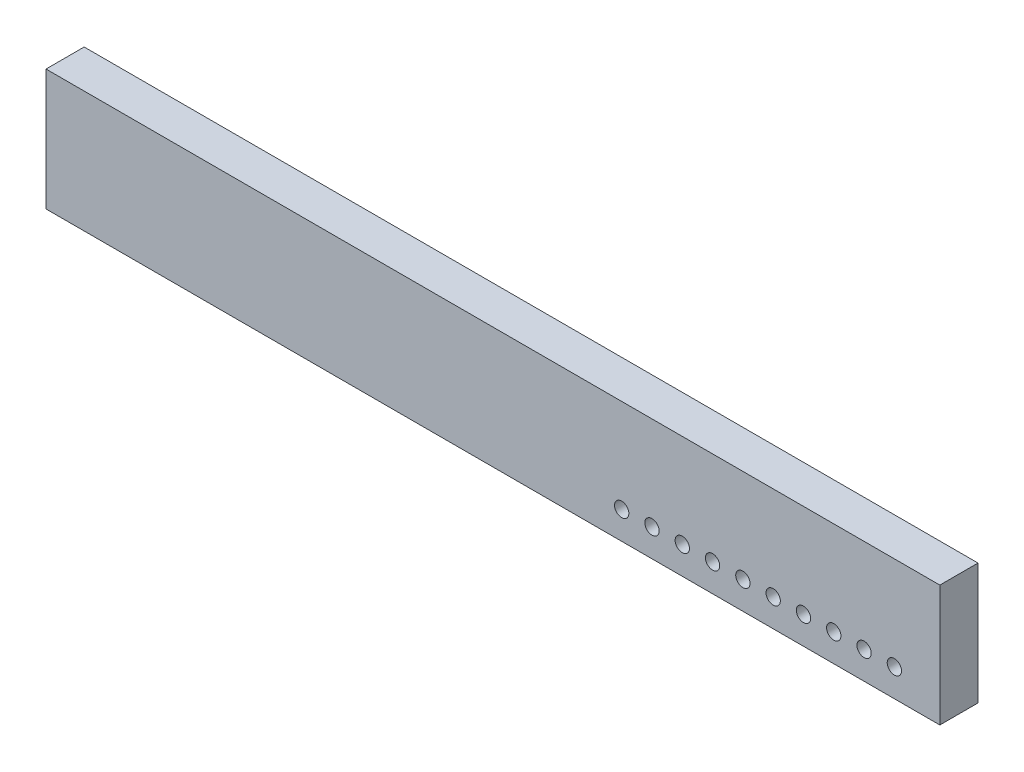
ISO-10303-21;
HEADER;
FILE_DESCRIPTION(('STEP AP214'),'2;1');
FILE_NAME('part.step','',(''),(''),'','','');
FILE_SCHEMA(('AUTOMOTIVE_DESIGN { 1 0 10303 214 1 1 1 1 }'));
ENDSEC;
DATA;
#1=APPLICATION_CONTEXT('core data for automotive mechanical design processes');
#2=APPLICATION_PROTOCOL_DEFINITION('international standard','automotive_design',2000,#1);
#3=PRODUCT_CONTEXT('',#1,'mechanical');
#4=PRODUCT('Part','Part','',(#3));
#5=PRODUCT_RELATED_PRODUCT_CATEGORY('part','',(#4));
#6=PRODUCT_DEFINITION_FORMATION('','',#4);
#7=PRODUCT_DEFINITION_CONTEXT('part definition',#1,'design');
#8=PRODUCT_DEFINITION('design','',#6,#7);
#9=PRODUCT_DEFINITION_SHAPE('','',#8);
#10=(LENGTH_UNIT() NAMED_UNIT(*) SI_UNIT(.MILLI.,.METRE.));
#11=(NAMED_UNIT(*) PLANE_ANGLE_UNIT() SI_UNIT($,.RADIAN.));
#12=(NAMED_UNIT(*) SI_UNIT($,.STERADIAN.) SOLID_ANGLE_UNIT());
#13=UNCERTAINTY_MEASURE_WITH_UNIT(LENGTH_MEASURE(1.E-05),#10,'distance_accuracy_value','');
#14=(GEOMETRIC_REPRESENTATION_CONTEXT(3) GLOBAL_UNCERTAINTY_ASSIGNED_CONTEXT((#13)) GLOBAL_UNIT_ASSIGNED_CONTEXT((#10,
#11,#12)) REPRESENTATION_CONTEXT('',''));
#15=CARTESIAN_POINT('',(0.,0.,0.));
#16=DIRECTION('',(0.,0.,1.));
#17=DIRECTION('',(1.,0.,0.));
#18=AXIS2_PLACEMENT_3D('',#15,#16,#17);
#19=CARTESIAN_POINT('',(18.7325,-2.54,1.6));
#20=DIRECTION('',(-1.,0.,0.));
#21=DIRECTION('',(0.,0.,1.));
#22=AXIS2_PLACEMENT_3D('',#19,#20,#21);
#23=PLANE('',#22);
#24=DIRECTION('',(0.,1.,0.));
#25=VECTOR('',#24,1.);
#26=CARTESIAN_POINT('',(18.7325,-2.54,0.));
#27=LINE('',#26,#25);
#28=CARTESIAN_POINT('',(18.7325,-2.54,0.));
#29=VERTEX_POINT('',#28);
#30=CARTESIAN_POINT('',(18.7325,2.54,0.));
#31=VERTEX_POINT('',#30);
#32=EDGE_CURVE('E100',#29,#31,#27,.T.);
#33=ORIENTED_EDGE('',*,*,#32,.T.);
#34=DIRECTION('',(0.,0.,-1.));
#35=VECTOR('',#34,1.);
#36=CARTESIAN_POINT('',(18.7325,2.54,1.6));
#37=LINE('',#36,#35);
#38=CARTESIAN_POINT('',(18.7325,2.54,1.6));
#39=VERTEX_POINT('',#38);
#40=EDGE_CURVE('E87',#39,#31,#37,.T.);
#41=ORIENTED_EDGE('',*,*,#40,.F.);
#42=DIRECTION('',(0.,1.,0.));
#43=VECTOR('',#42,1.);
#44=CARTESIAN_POINT('',(18.7325,-2.54,1.6));
#45=LINE('',#44,#43);
#46=CARTESIAN_POINT('',(18.7325,-2.54,1.6));
#47=VERTEX_POINT('',#46);
#48=EDGE_CURVE('E106',#47,#39,#45,.T.);
#49=ORIENTED_EDGE('',*,*,#48,.F.);
#50=DIRECTION('',(0.,0.,-1.));
#51=VECTOR('',#50,1.);
#52=CARTESIAN_POINT('',(18.7325,-2.54,1.6));
#53=LINE('',#52,#51);
#54=EDGE_CURVE('E89',#47,#29,#53,.T.);
#55=ORIENTED_EDGE('',*,*,#54,.T.);
#56=EDGE_LOOP('',(#33,#41,#49,#55));
#57=FACE_BOUND('',#56,.T.);
#58=ADVANCED_FACE('F32',(#57),#23,.F.);
#59=CARTESIAN_POINT('',(-18.7325,2.54,1.6));
#60=DIRECTION('',(0.,-1.,0.));
#61=DIRECTION('',(0.,0.,-1.));
#62=AXIS2_PLACEMENT_3D('',#59,#60,#61);
#63=PLANE('',#62);
#64=DIRECTION('',(-1.,0.,0.));
#65=VECTOR('',#64,1.);
#66=CARTESIAN_POINT('',(-18.7325,2.54,0.));
#67=LINE('',#66,#65);
#68=CARTESIAN_POINT('',(-18.7325,2.54,0.));
#69=VERTEX_POINT('',#68);
#70=EDGE_CURVE('E50',#31,#69,#67,.T.);
#71=ORIENTED_EDGE('',*,*,#70,.T.);
#72=DIRECTION('',(0.,0.,-1.));
#73=VECTOR('',#72,1.);
#74=CARTESIAN_POINT('',(-18.7325,2.54,1.6));
#75=LINE('',#74,#73);
#76=CARTESIAN_POINT('',(-18.7325,2.54,1.6));
#77=VERTEX_POINT('',#76);
#78=EDGE_CURVE('E84',#77,#69,#75,.T.);
#79=ORIENTED_EDGE('',*,*,#78,.F.);
#80=DIRECTION('',(-1.,0.,0.));
#81=VECTOR('',#80,1.);
#82=CARTESIAN_POINT('',(-18.7325,2.54,1.6));
#83=LINE('',#82,#81);
#84=EDGE_CURVE('E66',#39,#77,#83,.T.);
#85=ORIENTED_EDGE('',*,*,#84,.F.);
#86=ORIENTED_EDGE('',*,*,#40,.T.);
#87=EDGE_LOOP('',(#71,#79,#85,#86));
#88=FACE_BOUND('',#87,.T.);
#89=ADVANCED_FACE('F83',(#88),#63,.F.);
#90=CARTESIAN_POINT('',(-18.7325,-2.54,1.6));
#91=DIRECTION('',(1.,0.,0.));
#92=DIRECTION('',(0.,0.,-1.));
#93=AXIS2_PLACEMENT_3D('',#90,#91,#92);
#94=PLANE('',#93);
#95=DIRECTION('',(0.,-1.,0.));
#96=VECTOR('',#95,1.);
#97=CARTESIAN_POINT('',(-18.7325,-2.54,0.));
#98=LINE('',#97,#96);
#99=CARTESIAN_POINT('',(-18.7325,-2.54,0.));
#100=VERTEX_POINT('',#99);
#101=EDGE_CURVE('E81',#69,#100,#98,.T.);
#102=ORIENTED_EDGE('',*,*,#101,.T.);
#103=DIRECTION('',(0.,0.,-1.));
#104=VECTOR('',#103,1.);
#105=CARTESIAN_POINT('',(-18.7325,-2.54,1.6));
#106=LINE('',#105,#104);
#107=CARTESIAN_POINT('',(-18.7325,-2.54,1.6));
#108=VERTEX_POINT('',#107);
#109=EDGE_CURVE('E108',#108,#100,#106,.T.);
#110=ORIENTED_EDGE('',*,*,#109,.F.);
#111=DIRECTION('',(0.,-1.,0.));
#112=VECTOR('',#111,1.);
#113=CARTESIAN_POINT('',(-18.7325,-2.54,1.6));
#114=LINE('',#113,#112);
#115=EDGE_CURVE('E92',#77,#108,#114,.T.);
#116=ORIENTED_EDGE('',*,*,#115,.F.);
#117=ORIENTED_EDGE('',*,*,#78,.T.);
#118=EDGE_LOOP('',(#102,#110,#116,#117));
#119=FACE_BOUND('',#118,.T.);
#120=ADVANCED_FACE('F91',(#119),#94,.F.);
#121=CARTESIAN_POINT('',(-18.7325,-2.54,1.6));
#122=DIRECTION('',(0.,1.,0.));
#123=DIRECTION('',(0.,0.,1.));
#124=AXIS2_PLACEMENT_3D('',#121,#122,#123);
#125=PLANE('',#124);
#126=DIRECTION('',(1.,0.,0.));
#127=VECTOR('',#126,1.);
#128=CARTESIAN_POINT('',(-18.7325,-2.54,0.));
#129=LINE('',#128,#127);
#130=EDGE_CURVE('E75',#100,#29,#129,.T.);
#131=ORIENTED_EDGE('',*,*,#130,.T.);
#132=ORIENTED_EDGE('',*,*,#54,.F.);
#133=DIRECTION('',(1.,0.,0.));
#134=VECTOR('',#133,1.);
#135=CARTESIAN_POINT('',(-18.7325,-2.54,1.6));
#136=LINE('',#135,#134);
#137=EDGE_CURVE('E102',#108,#47,#136,.T.);
#138=ORIENTED_EDGE('',*,*,#137,.F.);
#139=ORIENTED_EDGE('',*,*,#109,.T.);
#140=EDGE_LOOP('',(#131,#132,#138,#139));
#141=FACE_BOUND('',#140,.T.);
#142=ADVANCED_FACE('F176',(#141),#125,.F.);
#143=CARTESIAN_POINT('',(0.,0.,1.6));
#144=DIRECTION('',(0.,0.,-1.));
#145=DIRECTION('',(-1.,0.,0.));
#146=AXIS2_PLACEMENT_3D('',#143,#144,#145);
#147=PLANE('',#146);
#148=CARTESIAN_POINT('',(5.39750000000004,-1.37999999999999,1.6));
#149=DIRECTION('',(0.,0.,1.));
#150=DIRECTION('',(1.,0.,0.));
#151=AXIS2_PLACEMENT_3D('',#148,#149,#150);
#152=CIRCLE('',#151,0.3);
#153=CARTESIAN_POINT('',(5.69750000000004,-1.37999999999999,1.6));
#154=VERTEX_POINT('',#153);
#155=EDGE_CURVE('E11',#154,#154,#152,.T.);
#156=ORIENTED_EDGE('',*,*,#155,.F.);
#157=EDGE_LOOP('',(#156));
#158=FACE_BOUND('',#157,.T.);
#159=CARTESIAN_POINT('',(6.66750000000004,-1.37999999999999,1.6));
#160=DIRECTION('',(0.,0.,1.));
#161=DIRECTION('',(1.,0.,0.));
#162=AXIS2_PLACEMENT_3D('',#159,#160,#161);
#163=CIRCLE('',#162,0.3);
#164=CARTESIAN_POINT('',(6.96750000000004,-1.37999999999999,1.6));
#165=VERTEX_POINT('',#164);
#166=EDGE_CURVE('E42',#165,#165,#163,.T.);
#167=ORIENTED_EDGE('',*,*,#166,.F.);
#168=EDGE_LOOP('',(#167));
#169=FACE_BOUND('',#168,.T.);
#170=CARTESIAN_POINT('',(7.93750000000004,-1.37999999999999,1.6));
#171=DIRECTION('',(0.,0.,1.));
#172=DIRECTION('',(1.,0.,0.));
#173=AXIS2_PLACEMENT_3D('',#170,#171,#172);
#174=CIRCLE('',#173,0.3);
#175=CARTESIAN_POINT('',(8.23750000000004,-1.37999999999999,1.6));
#176=VERTEX_POINT('',#175);
#177=EDGE_CURVE('E149',#176,#176,#174,.T.);
#178=ORIENTED_EDGE('',*,*,#177,.F.);
#179=EDGE_LOOP('',(#178));
#180=FACE_BOUND('',#179,.T.);
#181=CARTESIAN_POINT('',(9.20750000000004,-1.37999999999999,1.6));
#182=DIRECTION('',(0.,0.,1.));
#183=DIRECTION('',(1.,0.,0.));
#184=AXIS2_PLACEMENT_3D('',#181,#182,#183);
#185=CIRCLE('',#184,0.3);
#186=CARTESIAN_POINT('',(9.50750000000004,-1.37999999999999,1.6));
#187=VERTEX_POINT('',#186);
#188=EDGE_CURVE('E143',#187,#187,#185,.T.);
#189=ORIENTED_EDGE('',*,*,#188,.F.);
#190=EDGE_LOOP('',(#189));
#191=FACE_BOUND('',#190,.T.);
#192=CARTESIAN_POINT('',(10.4775,-1.37999999999999,1.6));
#193=DIRECTION('',(0.,0.,1.));
#194=DIRECTION('',(1.,0.,0.));
#195=AXIS2_PLACEMENT_3D('',#192,#193,#194);
#196=CIRCLE('',#195,0.3);
#197=CARTESIAN_POINT('',(10.7775,-1.37999999999999,1.6));
#198=VERTEX_POINT('',#197);
#199=EDGE_CURVE('E137',#198,#198,#196,.T.);
#200=ORIENTED_EDGE('',*,*,#199,.F.);
#201=EDGE_LOOP('',(#200));
#202=FACE_BOUND('',#201,.T.);
#203=CARTESIAN_POINT('',(11.7475,-1.37999999999999,1.6));
#204=DIRECTION('',(0.,0.,1.));
#205=DIRECTION('',(1.,0.,0.));
#206=AXIS2_PLACEMENT_3D('',#203,#204,#205);
#207=CIRCLE('',#206,0.3);
#208=CARTESIAN_POINT('',(12.0475,-1.37999999999999,1.6));
#209=VERTEX_POINT('',#208);
#210=EDGE_CURVE('E131',#209,#209,#207,.T.);
#211=ORIENTED_EDGE('',*,*,#210,.F.);
#212=EDGE_LOOP('',(#211));
#213=FACE_BOUND('',#212,.T.);
#214=CARTESIAN_POINT('',(13.0175,-1.37999999999999,1.6));
#215=DIRECTION('',(0.,0.,1.));
#216=DIRECTION('',(1.,0.,0.));
#217=AXIS2_PLACEMENT_3D('',#214,#215,#216);
#218=CIRCLE('',#217,0.3);
#219=CARTESIAN_POINT('',(13.3175,-1.37999999999999,1.6));
#220=VERTEX_POINT('',#219);
#221=EDGE_CURVE('E125',#220,#220,#218,.T.);
#222=ORIENTED_EDGE('',*,*,#221,.F.);
#223=EDGE_LOOP('',(#222));
#224=FACE_BOUND('',#223,.T.);
#225=CARTESIAN_POINT('',(14.2875,-1.37999999999999,1.6));
#226=DIRECTION('',(0.,0.,1.));
#227=DIRECTION('',(1.,0.,0.));
#228=AXIS2_PLACEMENT_3D('',#225,#226,#227);
#229=CIRCLE('',#228,0.3);
#230=CARTESIAN_POINT('',(14.5875,-1.37999999999999,1.6));
#231=VERTEX_POINT('',#230);
#232=EDGE_CURVE('E119',#231,#231,#229,.T.);
#233=ORIENTED_EDGE('',*,*,#232,.F.);
#234=EDGE_LOOP('',(#233));
#235=FACE_BOUND('',#234,.T.);
#236=CARTESIAN_POINT('',(15.5575,-1.37999999999999,1.6));
#237=DIRECTION('',(0.,0.,1.));
#238=DIRECTION('',(1.,0.,0.));
#239=AXIS2_PLACEMENT_3D('',#236,#237,#238);
#240=CIRCLE('',#239,0.3);
#241=CARTESIAN_POINT('',(15.8575,-1.37999999999999,1.6));
#242=VERTEX_POINT('',#241);
#243=EDGE_CURVE('E112',#242,#242,#240,.T.);
#244=ORIENTED_EDGE('',*,*,#243,.F.);
#245=EDGE_LOOP('',(#244));
#246=FACE_BOUND('',#245,.T.);
#247=CARTESIAN_POINT('',(16.8275,-1.37999999999999,1.6));
#248=DIRECTION('',(0.,0.,1.));
#249=DIRECTION('',(1.,0.,0.));
#250=AXIS2_PLACEMENT_3D('',#247,#248,#249);
#251=CIRCLE('',#250,0.3);
#252=CARTESIAN_POINT('',(17.1275,-1.37999999999999,1.6));
#253=VERTEX_POINT('',#252);
#254=EDGE_CURVE('E109',#253,#253,#251,.T.);
#255=ORIENTED_EDGE('',*,*,#254,.F.);
#256=EDGE_LOOP('',(#255));
#257=FACE_BOUND('',#256,.T.);
#258=ORIENTED_EDGE('',*,*,#48,.T.);
#259=ORIENTED_EDGE('',*,*,#84,.T.);
#260=ORIENTED_EDGE('',*,*,#115,.T.);
#261=ORIENTED_EDGE('',*,*,#137,.T.);
#262=EDGE_LOOP('',(#258,#259,#260,#261));
#263=FACE_BOUND('',#262,.T.);
#264=ADVANCED_FACE('F34',(#158,#169,#180,#191,#202,#213,#224,#235,#246,#257,#263),#147,.F.);
#265=CARTESIAN_POINT('',(0.,0.,0.));
#266=DIRECTION('',(0.,0.,-1.));
#267=DIRECTION('',(-1.,0.,0.));
#268=AXIS2_PLACEMENT_3D('',#265,#266,#267);
#269=PLANE('',#268);
#270=CARTESIAN_POINT('',(5.39750000000004,-1.37999999999999,0.));
#271=DIRECTION('',(0.,0.,1.));
#272=DIRECTION('',(1.,0.,0.));
#273=AXIS2_PLACEMENT_3D('',#270,#271,#272);
#274=CIRCLE('',#273,0.3);
#275=CARTESIAN_POINT('',(5.69750000000004,-1.37999999999999,0.));
#276=VERTEX_POINT('',#275);
#277=EDGE_CURVE('E36',#276,#276,#274,.T.);
#278=ORIENTED_EDGE('',*,*,#277,.T.);
#279=EDGE_LOOP('',(#278));
#280=FACE_BOUND('',#279,.T.);
#281=CARTESIAN_POINT('',(6.66750000000004,-1.37999999999999,0.));
#282=DIRECTION('',(0.,0.,1.));
#283=DIRECTION('',(1.,0.,0.));
#284=AXIS2_PLACEMENT_3D('',#281,#282,#283);
#285=CIRCLE('',#284,0.3);
#286=CARTESIAN_POINT('',(6.96750000000004,-1.37999999999999,0.));
#287=VERTEX_POINT('',#286);
#288=EDGE_CURVE('E157',#287,#287,#285,.T.);
#289=ORIENTED_EDGE('',*,*,#288,.T.);
#290=EDGE_LOOP('',(#289));
#291=FACE_BOUND('',#290,.T.);
#292=CARTESIAN_POINT('',(7.93750000000004,-1.37999999999999,0.));
#293=DIRECTION('',(0.,0.,1.));
#294=DIRECTION('',(1.,0.,0.));
#295=AXIS2_PLACEMENT_3D('',#292,#293,#294);
#296=CIRCLE('',#295,0.3);
#297=CARTESIAN_POINT('',(8.23750000000004,-1.37999999999999,0.));
#298=VERTEX_POINT('',#297);
#299=EDGE_CURVE('E152',#298,#298,#296,.T.);
#300=ORIENTED_EDGE('',*,*,#299,.T.);
#301=EDGE_LOOP('',(#300));
#302=FACE_BOUND('',#301,.T.);
#303=CARTESIAN_POINT('',(9.20750000000004,-1.37999999999999,0.));
#304=DIRECTION('',(0.,0.,1.));
#305=DIRECTION('',(1.,0.,0.));
#306=AXIS2_PLACEMENT_3D('',#303,#304,#305);
#307=CIRCLE('',#306,0.3);
#308=CARTESIAN_POINT('',(9.50750000000004,-1.37999999999999,0.));
#309=VERTEX_POINT('',#308);
#310=EDGE_CURVE('E146',#309,#309,#307,.T.);
#311=ORIENTED_EDGE('',*,*,#310,.T.);
#312=EDGE_LOOP('',(#311));
#313=FACE_BOUND('',#312,.T.);
#314=CARTESIAN_POINT('',(10.4775,-1.37999999999999,0.));
#315=DIRECTION('',(0.,0.,1.));
#316=DIRECTION('',(1.,0.,0.));
#317=AXIS2_PLACEMENT_3D('',#314,#315,#316);
#318=CIRCLE('',#317,0.3);
#319=CARTESIAN_POINT('',(10.7775,-1.37999999999999,0.));
#320=VERTEX_POINT('',#319);
#321=EDGE_CURVE('E140',#320,#320,#318,.T.);
#322=ORIENTED_EDGE('',*,*,#321,.T.);
#323=EDGE_LOOP('',(#322));
#324=FACE_BOUND('',#323,.T.);
#325=CARTESIAN_POINT('',(11.7475,-1.37999999999999,0.));
#326=DIRECTION('',(0.,0.,1.));
#327=DIRECTION('',(1.,0.,0.));
#328=AXIS2_PLACEMENT_3D('',#325,#326,#327);
#329=CIRCLE('',#328,0.3);
#330=CARTESIAN_POINT('',(12.0475,-1.37999999999999,0.));
#331=VERTEX_POINT('',#330);
#332=EDGE_CURVE('E134',#331,#331,#329,.T.);
#333=ORIENTED_EDGE('',*,*,#332,.T.);
#334=EDGE_LOOP('',(#333));
#335=FACE_BOUND('',#334,.T.);
#336=CARTESIAN_POINT('',(13.0175,-1.37999999999999,0.));
#337=DIRECTION('',(0.,0.,1.));
#338=DIRECTION('',(1.,0.,0.));
#339=AXIS2_PLACEMENT_3D('',#336,#337,#338);
#340=CIRCLE('',#339,0.3);
#341=CARTESIAN_POINT('',(13.3175,-1.37999999999999,0.));
#342=VERTEX_POINT('',#341);
#343=EDGE_CURVE('E128',#342,#342,#340,.T.);
#344=ORIENTED_EDGE('',*,*,#343,.T.);
#345=EDGE_LOOP('',(#344));
#346=FACE_BOUND('',#345,.T.);
#347=CARTESIAN_POINT('',(14.2875,-1.37999999999999,0.));
#348=DIRECTION('',(0.,0.,1.));
#349=DIRECTION('',(1.,0.,0.));
#350=AXIS2_PLACEMENT_3D('',#347,#348,#349);
#351=CIRCLE('',#350,0.3);
#352=CARTESIAN_POINT('',(14.5875,-1.37999999999999,0.));
#353=VERTEX_POINT('',#352);
#354=EDGE_CURVE('E122',#353,#353,#351,.T.);
#355=ORIENTED_EDGE('',*,*,#354,.T.);
#356=EDGE_LOOP('',(#355));
#357=FACE_BOUND('',#356,.T.);
#358=CARTESIAN_POINT('',(15.5575,-1.37999999999999,0.));
#359=DIRECTION('',(0.,0.,1.));
#360=DIRECTION('',(1.,0.,0.));
#361=AXIS2_PLACEMENT_3D('',#358,#359,#360);
#362=CIRCLE('',#361,0.3);
#363=CARTESIAN_POINT('',(15.8575,-1.37999999999999,0.));
#364=VERTEX_POINT('',#363);
#365=EDGE_CURVE('E116',#364,#364,#362,.T.);
#366=ORIENTED_EDGE('',*,*,#365,.T.);
#367=EDGE_LOOP('',(#366));
#368=FACE_BOUND('',#367,.T.);
#369=CARTESIAN_POINT('',(16.8275,-1.37999999999999,0.));
#370=DIRECTION('',(0.,0.,1.));
#371=DIRECTION('',(1.,0.,0.));
#372=AXIS2_PLACEMENT_3D('',#369,#370,#371);
#373=CIRCLE('',#372,0.3);
#374=CARTESIAN_POINT('',(17.1275,-1.37999999999999,0.));
#375=VERTEX_POINT('',#374);
#376=EDGE_CURVE('E113',#375,#375,#373,.T.);
#377=ORIENTED_EDGE('',*,*,#376,.T.);
#378=EDGE_LOOP('',(#377));
#379=FACE_BOUND('',#378,.T.);
#380=ORIENTED_EDGE('',*,*,#32,.F.);
#381=ORIENTED_EDGE('',*,*,#130,.F.);
#382=ORIENTED_EDGE('',*,*,#101,.F.);
#383=ORIENTED_EDGE('',*,*,#70,.F.);
#384=EDGE_LOOP('',(#380,#381,#382,#383));
#385=FACE_BOUND('',#384,.T.);
#386=ADVANCED_FACE('F94',(#280,#291,#302,#313,#324,#335,#346,#357,#368,#379,#385),#269,.T.);
#387=CARTESIAN_POINT('',(16.8275,-1.37999999999999,0.));
#388=DIRECTION('',(0.,0.,1.));
#389=DIRECTION('',(1.,0.,0.));
#390=AXIS2_PLACEMENT_3D('',#387,#388,#389);
#391=CYLINDRICAL_SURFACE('',#390,0.3);
#392=ORIENTED_EDGE('',*,*,#376,.F.);
#393=EDGE_LOOP('',(#392));
#394=FACE_BOUND('',#393,.T.);
#395=ORIENTED_EDGE('',*,*,#254,.T.);
#396=EDGE_LOOP('',(#395));
#397=FACE_BOUND('',#396,.T.);
#398=ADVANCED_FACE('F236',(#394,#397),#391,.F.);
#399=CARTESIAN_POINT('',(15.5575,-1.37999999999999,0.));
#400=DIRECTION('',(0.,0.,1.));
#401=DIRECTION('',(1.,0.,0.));
#402=AXIS2_PLACEMENT_3D('',#399,#400,#401);
#403=CYLINDRICAL_SURFACE('',#402,0.3);
#404=ORIENTED_EDGE('',*,*,#365,.F.);
#405=EDGE_LOOP('',(#404));
#406=FACE_BOUND('',#405,.T.);
#407=ORIENTED_EDGE('',*,*,#243,.T.);
#408=EDGE_LOOP('',(#407));
#409=FACE_BOUND('',#408,.T.);
#410=ADVANCED_FACE('F244',(#406,#409),#403,.F.);
#411=CARTESIAN_POINT('',(14.2875,-1.37999999999999,0.));
#412=DIRECTION('',(0.,0.,1.));
#413=DIRECTION('',(1.,0.,0.));
#414=AXIS2_PLACEMENT_3D('',#411,#412,#413);
#415=CYLINDRICAL_SURFACE('',#414,0.3);
#416=ORIENTED_EDGE('',*,*,#354,.F.);
#417=EDGE_LOOP('',(#416));
#418=FACE_BOUND('',#417,.T.);
#419=ORIENTED_EDGE('',*,*,#232,.T.);
#420=EDGE_LOOP('',(#419));
#421=FACE_BOUND('',#420,.T.);
#422=ADVANCED_FACE('F250',(#418,#421),#415,.F.);
#423=CARTESIAN_POINT('',(13.0175,-1.37999999999999,0.));
#424=DIRECTION('',(0.,0.,1.));
#425=DIRECTION('',(1.,0.,0.));
#426=AXIS2_PLACEMENT_3D('',#423,#424,#425);
#427=CYLINDRICAL_SURFACE('',#426,0.3);
#428=ORIENTED_EDGE('',*,*,#343,.F.);
#429=EDGE_LOOP('',(#428));
#430=FACE_BOUND('',#429,.T.);
#431=ORIENTED_EDGE('',*,*,#221,.T.);
#432=EDGE_LOOP('',(#431));
#433=FACE_BOUND('',#432,.T.);
#434=ADVANCED_FACE('F258',(#430,#433),#427,.F.);
#435=CARTESIAN_POINT('',(11.7475,-1.37999999999999,0.));
#436=DIRECTION('',(0.,0.,1.));
#437=DIRECTION('',(1.,0.,0.));
#438=AXIS2_PLACEMENT_3D('',#435,#436,#437);
#439=CYLINDRICAL_SURFACE('',#438,0.3);
#440=ORIENTED_EDGE('',*,*,#332,.F.);
#441=EDGE_LOOP('',(#440));
#442=FACE_BOUND('',#441,.T.);
#443=ORIENTED_EDGE('',*,*,#210,.T.);
#444=EDGE_LOOP('',(#443));
#445=FACE_BOUND('',#444,.T.);
#446=ADVANCED_FACE('F266',(#442,#445),#439,.F.);
#447=CARTESIAN_POINT('',(10.4775,-1.37999999999999,0.));
#448=DIRECTION('',(0.,0.,1.));
#449=DIRECTION('',(1.,0.,0.));
#450=AXIS2_PLACEMENT_3D('',#447,#448,#449);
#451=CYLINDRICAL_SURFACE('',#450,0.3);
#452=ORIENTED_EDGE('',*,*,#321,.F.);
#453=EDGE_LOOP('',(#452));
#454=FACE_BOUND('',#453,.T.);
#455=ORIENTED_EDGE('',*,*,#199,.T.);
#456=EDGE_LOOP('',(#455));
#457=FACE_BOUND('',#456,.T.);
#458=ADVANCED_FACE('F274',(#454,#457),#451,.F.);
#459=CARTESIAN_POINT('',(9.20750000000004,-1.37999999999999,0.));
#460=DIRECTION('',(0.,0.,1.));
#461=DIRECTION('',(1.,0.,0.));
#462=AXIS2_PLACEMENT_3D('',#459,#460,#461);
#463=CYLINDRICAL_SURFACE('',#462,0.3);
#464=ORIENTED_EDGE('',*,*,#310,.F.);
#465=EDGE_LOOP('',(#464));
#466=FACE_BOUND('',#465,.T.);
#467=ORIENTED_EDGE('',*,*,#188,.T.);
#468=EDGE_LOOP('',(#467));
#469=FACE_BOUND('',#468,.T.);
#470=ADVANCED_FACE('F282',(#466,#469),#463,.F.);
#471=CARTESIAN_POINT('',(7.93750000000004,-1.37999999999999,0.));
#472=DIRECTION('',(0.,0.,1.));
#473=DIRECTION('',(1.,0.,0.));
#474=AXIS2_PLACEMENT_3D('',#471,#472,#473);
#475=CYLINDRICAL_SURFACE('',#474,0.3);
#476=ORIENTED_EDGE('',*,*,#299,.F.);
#477=EDGE_LOOP('',(#476));
#478=FACE_BOUND('',#477,.T.);
#479=ORIENTED_EDGE('',*,*,#177,.T.);
#480=EDGE_LOOP('',(#479));
#481=FACE_BOUND('',#480,.T.);
#482=ADVANCED_FACE('F290',(#478,#481),#475,.F.);
#483=CARTESIAN_POINT('',(6.66750000000004,-1.37999999999999,0.));
#484=DIRECTION('',(0.,0.,1.));
#485=DIRECTION('',(1.,0.,0.));
#486=AXIS2_PLACEMENT_3D('',#483,#484,#485);
#487=CYLINDRICAL_SURFACE('',#486,0.3);
#488=ORIENTED_EDGE('',*,*,#288,.F.);
#489=EDGE_LOOP('',(#488));
#490=FACE_BOUND('',#489,.T.);
#491=ORIENTED_EDGE('',*,*,#166,.T.);
#492=EDGE_LOOP('',(#491));
#493=FACE_BOUND('',#492,.T.);
#494=ADVANCED_FACE('F170',(#490,#493),#487,.F.);
#495=CARTESIAN_POINT('',(5.39750000000004,-1.37999999999999,0.));
#496=DIRECTION('',(0.,0.,1.));
#497=DIRECTION('',(1.,0.,0.));
#498=AXIS2_PLACEMENT_3D('',#495,#496,#497);
#499=CYLINDRICAL_SURFACE('',#498,0.3);
#500=ORIENTED_EDGE('',*,*,#277,.F.);
#501=EDGE_LOOP('',(#500));
#502=FACE_BOUND('',#501,.T.);
#503=ORIENTED_EDGE('',*,*,#155,.T.);
#504=EDGE_LOOP('',(#503));
#505=FACE_BOUND('',#504,.T.);
#506=ADVANCED_FACE('F167',(#502,#505),#499,.F.);
#507=CLOSED_SHELL('',(#58,#89,#120,#142,#264,#386,#398,#410,#422,#434,#446,#458,#470,#482,#494,#506));
#508=MANIFOLD_SOLID_BREP('B2',#507);
#509=ADVANCED_BREP_SHAPE_REPRESENTATION('',(#18,#508),#14);
#510=SHAPE_DEFINITION_REPRESENTATION(#9,#509);
ENDSEC;
END-ISO-10303-21;
